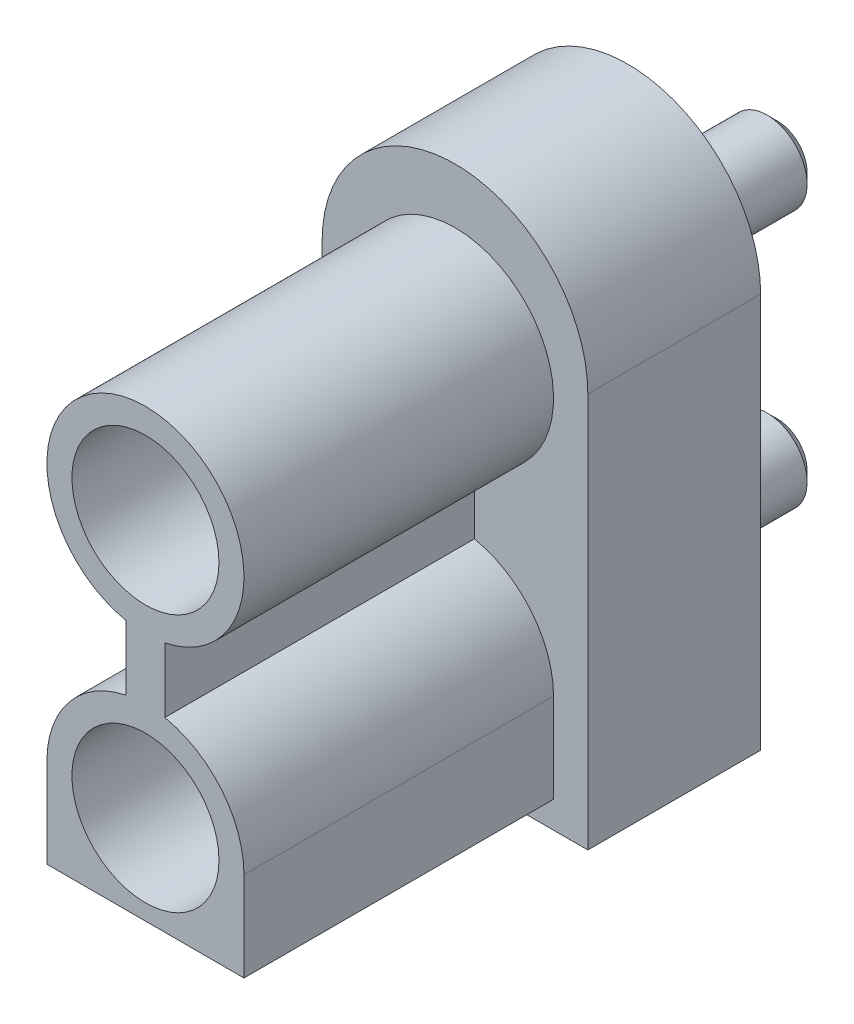
ISO-10303-21;
HEADER;
FILE_DESCRIPTION(('STEP AP214'),'2;1');
FILE_NAME('part.step','',(''),(''),'','','');
FILE_SCHEMA(('AUTOMOTIVE_DESIGN { 1 0 10303 214 1 1 1 1 }'));
ENDSEC;
DATA;
#1=APPLICATION_CONTEXT('core data for automotive mechanical design processes');
#2=APPLICATION_PROTOCOL_DEFINITION('international standard','automotive_design',2000,#1);
#3=PRODUCT_CONTEXT('',#1,'mechanical');
#4=PRODUCT('Part','Part','',(#3));
#5=PRODUCT_RELATED_PRODUCT_CATEGORY('part','',(#4));
#6=PRODUCT_DEFINITION_FORMATION('','',#4);
#7=PRODUCT_DEFINITION_CONTEXT('part definition',#1,'design');
#8=PRODUCT_DEFINITION('design','',#6,#7);
#9=PRODUCT_DEFINITION_SHAPE('','',#8);
#10=(LENGTH_UNIT() NAMED_UNIT(*) SI_UNIT(.MILLI.,.METRE.));
#11=(NAMED_UNIT(*) PLANE_ANGLE_UNIT() SI_UNIT($,.RADIAN.));
#12=(NAMED_UNIT(*) SI_UNIT($,.STERADIAN.) SOLID_ANGLE_UNIT());
#13=UNCERTAINTY_MEASURE_WITH_UNIT(LENGTH_MEASURE(1.E-05),#10,'distance_accuracy_value','');
#14=(GEOMETRIC_REPRESENTATION_CONTEXT(3) GLOBAL_UNCERTAINTY_ASSIGNED_CONTEXT((#13)) GLOBAL_UNIT_ASSIGNED_CONTEXT((#10,
#11,#12)) REPRESENTATION_CONTEXT('',''));
#15=CARTESIAN_POINT('',(0.,0.,0.));
#16=DIRECTION('',(0.,0.,1.));
#17=DIRECTION('',(1.,0.,0.));
#18=AXIS2_PLACEMENT_3D('',#15,#16,#17);
#19=CARTESIAN_POINT('',(0.,7.655,3.35));
#20=DIRECTION('',(0.,0.,-1.));
#21=DIRECTION('',(-1.,0.,0.));
#22=AXIS2_PLACEMENT_3D('',#19,#20,#21);
#23=CYLINDRICAL_SURFACE('',#22,2.575);
#24=CARTESIAN_POINT('',(0.,7.655,0.));
#25=DIRECTION('',(0.,0.,1.));
#26=DIRECTION('',(-1.,0.,0.));
#27=AXIS2_PLACEMENT_3D('',#24,#25,#26);
#28=CIRCLE('',#27,2.575);
#29=CARTESIAN_POINT('',(2.575,7.655,0.));
#30=VERTEX_POINT('',#29);
#31=CARTESIAN_POINT('',(-2.575,7.655,0.));
#32=VERTEX_POINT('',#31);
#33=EDGE_CURVE('E161',#30,#32,#28,.T.);
#34=ORIENTED_EDGE('',*,*,#33,.T.);
#35=DIRECTION('',(0.,0.,-1.));
#36=VECTOR('',#35,1.);
#37=CARTESIAN_POINT('',(-2.575,7.655,3.35));
#38=LINE('',#37,#36);
#39=CARTESIAN_POINT('',(-2.575,7.655,3.35));
#40=VERTEX_POINT('',#39);
#41=EDGE_CURVE('E188',#40,#32,#38,.T.);
#42=ORIENTED_EDGE('',*,*,#41,.F.);
#43=CARTESIAN_POINT('',(0.,7.655,3.35));
#44=DIRECTION('',(0.,0.,1.));
#45=DIRECTION('',(-1.,0.,0.));
#46=AXIS2_PLACEMENT_3D('',#43,#44,#45);
#47=CIRCLE('',#46,2.575);
#48=CARTESIAN_POINT('',(2.575,7.655,3.35));
#49=VERTEX_POINT('',#48);
#50=EDGE_CURVE('E162',#49,#40,#47,.T.);
#51=ORIENTED_EDGE('',*,*,#50,.F.);
#52=DIRECTION('',(0.,0.,-1.));
#53=VECTOR('',#52,1.);
#54=CARTESIAN_POINT('',(2.575,7.655,3.35));
#55=LINE('',#54,#53);
#56=EDGE_CURVE('E172',#49,#30,#55,.T.);
#57=ORIENTED_EDGE('',*,*,#56,.T.);
#58=EDGE_LOOP('',(#34,#42,#51,#57));
#59=FACE_BOUND('',#58,.T.);
#60=ADVANCED_FACE('F38',(#59),#23,.T.);
#61=CARTESIAN_POINT('',(-2.575,7.655,3.35));
#62=DIRECTION('',(1.,0.,0.));
#63=DIRECTION('',(0.,1.,0.));
#64=AXIS2_PLACEMENT_3D('',#61,#62,#63);
#65=PLANE('',#64);
#66=DIRECTION('',(0.,-1.,0.));
#67=VECTOR('',#66,1.);
#68=CARTESIAN_POINT('',(-2.575,7.655,0.));
#69=LINE('',#68,#67);
#70=CARTESIAN_POINT('',(-2.575,0.,0.));
#71=VERTEX_POINT('',#70);
#72=EDGE_CURVE('E175',#32,#71,#69,.T.);
#73=ORIENTED_EDGE('',*,*,#72,.T.);
#74=DIRECTION('',(0.,0.,-1.));
#75=VECTOR('',#74,1.);
#76=CARTESIAN_POINT('',(-2.575,0.,3.35));
#77=LINE('',#76,#75);
#78=CARTESIAN_POINT('',(-2.575,0.,3.35));
#79=VERTEX_POINT('',#78);
#80=EDGE_CURVE('E185',#79,#71,#77,.T.);
#81=ORIENTED_EDGE('',*,*,#80,.F.);
#82=DIRECTION('',(0.,-1.,0.));
#83=VECTOR('',#82,1.);
#84=CARTESIAN_POINT('',(-2.575,7.655,3.35));
#85=LINE('',#84,#83);
#86=EDGE_CURVE('E165',#40,#79,#85,.T.);
#87=ORIENTED_EDGE('',*,*,#86,.F.);
#88=ORIENTED_EDGE('',*,*,#41,.T.);
#89=EDGE_LOOP('',(#73,#81,#87,#88));
#90=FACE_BOUND('',#89,.T.);
#91=ADVANCED_FACE('F213',(#90),#65,.F.);
#92=CARTESIAN_POINT('',(-2.575,0.,3.35));
#93=DIRECTION('',(0.,1.,0.));
#94=DIRECTION('',(0.,0.,1.));
#95=AXIS2_PLACEMENT_3D('',#92,#93,#94);
#96=PLANE('',#95);
#97=DIRECTION('',(1.,0.,0.));
#98=VECTOR('',#97,1.);
#99=CARTESIAN_POINT('',(-2.575,0.,0.));
#100=LINE('',#99,#98);
#101=CARTESIAN_POINT('',(2.575,0.,0.));
#102=VERTEX_POINT('',#101);
#103=EDGE_CURVE('E177',#71,#102,#100,.T.);
#104=ORIENTED_EDGE('',*,*,#103,.T.);
#105=DIRECTION('',(0.,0.,-1.));
#106=VECTOR('',#105,1.);
#107=CARTESIAN_POINT('',(2.575,0.,3.35));
#108=LINE('',#107,#106);
#109=CARTESIAN_POINT('',(2.575,0.,3.35));
#110=VERTEX_POINT('',#109);
#111=EDGE_CURVE('E182',#110,#102,#108,.T.);
#112=ORIENTED_EDGE('',*,*,#111,.F.);
#113=DIRECTION('',(1.,0.,0.));
#114=VECTOR('',#113,1.);
#115=CARTESIAN_POINT('',(-2.575,0.,3.35));
#116=LINE('',#115,#114);
#117=EDGE_CURVE('E168',#79,#110,#116,.T.);
#118=ORIENTED_EDGE('',*,*,#117,.F.);
#119=ORIENTED_EDGE('',*,*,#80,.T.);
#120=EDGE_LOOP('',(#104,#112,#118,#119));
#121=FACE_BOUND('',#120,.T.);
#122=ADVANCED_FACE('F219',(#121),#96,.F.);
#123=CARTESIAN_POINT('',(2.575,0.,3.35));
#124=DIRECTION('',(-1.,0.,0.));
#125=DIRECTION('',(0.,-1.,0.));
#126=AXIS2_PLACEMENT_3D('',#123,#124,#125);
#127=PLANE('',#126);
#128=DIRECTION('',(0.,1.,0.));
#129=VECTOR('',#128,1.);
#130=CARTESIAN_POINT('',(2.575,0.,0.));
#131=LINE('',#130,#129);
#132=EDGE_CURVE('E166',#102,#30,#131,.T.);
#133=ORIENTED_EDGE('',*,*,#132,.T.);
#134=ORIENTED_EDGE('',*,*,#56,.F.);
#135=DIRECTION('',(0.,1.,0.));
#136=VECTOR('',#135,1.);
#137=CARTESIAN_POINT('',(2.575,0.,3.35));
#138=LINE('',#137,#136);
#139=EDGE_CURVE('E170',#110,#49,#138,.T.);
#140=ORIENTED_EDGE('',*,*,#139,.F.);
#141=ORIENTED_EDGE('',*,*,#111,.T.);
#142=EDGE_LOOP('',(#133,#134,#140,#141));
#143=FACE_BOUND('',#142,.T.);
#144=ADVANCED_FACE('F230',(#143),#127,.F.);
#145=CARTESIAN_POINT('',(0.,7.655,3.35));
#146=DIRECTION('',(0.,0.,-1.));
#147=DIRECTION('',(-1.,0.,0.));
#148=AXIS2_PLACEMENT_3D('',#145,#146,#147);
#149=PLANE('',#148);
#150=CARTESIAN_POINT('',(0.,2.25,3.35));
#151=DIRECTION('',(0.,0.,1.));
#152=DIRECTION('',(-1.,0.,0.));
#153=AXIS2_PLACEMENT_3D('',#150,#151,#152);
#154=CIRCLE('',#153,1.91);
#155=CARTESIAN_POINT('',(-0.375,4.12282540563716,3.35));
#156=VERTEX_POINT('',#155);
#157=CARTESIAN_POINT('',(-1.91,2.25,3.35));
#158=VERTEX_POINT('',#157);
#159=EDGE_CURVE('E149',#156,#158,#154,.T.);
#160=ORIENTED_EDGE('',*,*,#159,.F.);
#161=DIRECTION('',(0.,-1.,0.));
#162=VECTOR('',#161,1.);
#163=CARTESIAN_POINT('',(-0.375,5.37717459436284,3.35));
#164=LINE('',#163,#162);
#165=CARTESIAN_POINT('',(-0.375,5.37717459436284,3.35));
#166=VERTEX_POINT('',#165);
#167=EDGE_CURVE('E146',#166,#156,#164,.T.);
#168=ORIENTED_EDGE('',*,*,#167,.F.);
#169=CARTESIAN_POINT('',(0.,7.25,3.35));
#170=DIRECTION('',(0.,0.,1.));
#171=DIRECTION('',(1.,0.,0.));
#172=AXIS2_PLACEMENT_3D('',#169,#170,#171);
#173=CIRCLE('',#172,1.91);
#174=CARTESIAN_POINT('',(0.375,5.37717459436284,3.35));
#175=VERTEX_POINT('',#174);
#176=EDGE_CURVE('E336',#175,#166,#173,.T.);
#177=ORIENTED_EDGE('',*,*,#176,.F.);
#178=DIRECTION('',(0.,1.,0.));
#179=VECTOR('',#178,1.);
#180=CARTESIAN_POINT('',(0.375,5.37717459436284,3.35));
#181=LINE('',#180,#179);
#182=CARTESIAN_POINT('',(0.375000000000001,4.12282540563716,3.35));
#183=VERTEX_POINT('',#182);
#184=EDGE_CURVE('E333',#183,#175,#181,.T.);
#185=ORIENTED_EDGE('',*,*,#184,.F.);
#186=CARTESIAN_POINT('',(0.,2.25,3.35));
#187=DIRECTION('',(0.,0.,1.));
#188=DIRECTION('',(-1.,0.,0.));
#189=AXIS2_PLACEMENT_3D('',#186,#187,#188);
#190=CIRCLE('',#189,1.91);
#191=CARTESIAN_POINT('',(1.91,2.25,3.35));
#192=VERTEX_POINT('',#191);
#193=EDGE_CURVE('E330',#192,#183,#190,.T.);
#194=ORIENTED_EDGE('',*,*,#193,.F.);
#195=DIRECTION('',(0.,1.,0.));
#196=VECTOR('',#195,1.);
#197=CARTESIAN_POINT('',(1.91,0.518598550380402,3.35));
#198=LINE('',#197,#196);
#199=CARTESIAN_POINT('',(1.91,0.518598550380402,3.35));
#200=VERTEX_POINT('',#199);
#201=EDGE_CURVE('E327',#200,#192,#198,.T.);
#202=ORIENTED_EDGE('',*,*,#201,.F.);
#203=DIRECTION('',(1.,0.,0.));
#204=VECTOR('',#203,1.);
#205=CARTESIAN_POINT('',(-1.91,0.518598550380402,3.35));
#206=LINE('',#205,#204);
#207=CARTESIAN_POINT('',(-1.91,0.518598550380402,3.35));
#208=VERTEX_POINT('',#207);
#209=EDGE_CURVE('E59',#208,#200,#206,.T.);
#210=ORIENTED_EDGE('',*,*,#209,.F.);
#211=DIRECTION('',(0.,-1.,0.));
#212=VECTOR('',#211,1.);
#213=CARTESIAN_POINT('',(-1.91,2.25,3.35));
#214=LINE('',#213,#212);
#215=EDGE_CURVE('E54',#158,#208,#214,.T.);
#216=ORIENTED_EDGE('',*,*,#215,.F.);
#217=EDGE_LOOP('',(#160,#168,#177,#185,#194,#202,#210,#216));
#218=FACE_BOUND('',#217,.T.);
#219=ORIENTED_EDGE('',*,*,#50,.T.);
#220=ORIENTED_EDGE('',*,*,#86,.T.);
#221=ORIENTED_EDGE('',*,*,#117,.T.);
#222=ORIENTED_EDGE('',*,*,#139,.T.);
#223=EDGE_LOOP('',(#219,#220,#221,#222));
#224=FACE_BOUND('',#223,.T.);
#225=ADVANCED_FACE('F234',(#218,#224),#149,.F.);
#226=CARTESIAN_POINT('',(0.,7.655,0.));
#227=DIRECTION('',(0.,0.,-1.));
#228=DIRECTION('',(-1.,0.,0.));
#229=AXIS2_PLACEMENT_3D('',#226,#227,#228);
#230=PLANE('',#229);
#231=CARTESIAN_POINT('',(0.,2.25,0.));
#232=DIRECTION('',(0.,0.,-1.));
#233=DIRECTION('',(-1.,0.,0.));
#234=AXIS2_PLACEMENT_3D('',#231,#232,#233);
#235=CIRCLE('',#234,0.775);
#236=CARTESIAN_POINT('',(-0.775,2.25,0.));
#237=VERTEX_POINT('',#236);
#238=EDGE_CURVE('E150',#237,#237,#235,.T.);
#239=ORIENTED_EDGE('',*,*,#238,.F.);
#240=EDGE_LOOP('',(#239));
#241=FACE_BOUND('',#240,.T.);
#242=CARTESIAN_POINT('',(0.,7.25,0.));
#243=DIRECTION('',(0.,0.,-1.));
#244=DIRECTION('',(-1.,0.,0.));
#245=AXIS2_PLACEMENT_3D('',#242,#243,#244);
#246=CIRCLE('',#245,0.775);
#247=CARTESIAN_POINT('',(-0.775,7.25,0.));
#248=VERTEX_POINT('',#247);
#249=EDGE_CURVE('E153',#248,#248,#246,.T.);
#250=ORIENTED_EDGE('',*,*,#249,.F.);
#251=EDGE_LOOP('',(#250));
#252=FACE_BOUND('',#251,.T.);
#253=ORIENTED_EDGE('',*,*,#33,.F.);
#254=ORIENTED_EDGE('',*,*,#132,.F.);
#255=ORIENTED_EDGE('',*,*,#103,.F.);
#256=ORIENTED_EDGE('',*,*,#72,.F.);
#257=EDGE_LOOP('',(#253,#254,#255,#256));
#258=FACE_BOUND('',#257,.T.);
#259=ADVANCED_FACE('F236',(#241,#252,#258),#230,.T.);
#260=CARTESIAN_POINT('',(0.,7.25,-2.9));
#261=DIRECTION('',(0.,0.,1.));
#262=DIRECTION('',(1.,0.,0.));
#263=AXIS2_PLACEMENT_3D('',#260,#261,#262);
#264=CYLINDRICAL_SURFACE('',#263,0.775);
#265=CARTESIAN_POINT('',(0.,7.25,-2.7));
#266=DIRECTION('',(0.,0.,-1.));
#267=DIRECTION('',(-1.,0.,0.));
#268=AXIS2_PLACEMENT_3D('',#265,#266,#267);
#269=CIRCLE('',#268,0.775);
#270=CARTESIAN_POINT('',(-0.775,7.25,-2.7));
#271=VERTEX_POINT('',#270);
#272=EDGE_CURVE('E11',#271,#271,#269,.F.);
#273=ORIENTED_EDGE('',*,*,#272,.T.);
#274=EDGE_LOOP('',(#273));
#275=FACE_BOUND('',#274,.T.);
#276=ORIENTED_EDGE('',*,*,#249,.T.);
#277=EDGE_LOOP('',(#276));
#278=FACE_BOUND('',#277,.T.);
#279=ADVANCED_FACE('F239',(#275,#278),#264,.T.);
#280=CARTESIAN_POINT('',(0.,7.25,-2.9));
#281=DIRECTION('',(0.,0.,-1.));
#282=DIRECTION('',(-1.,0.,0.));
#283=AXIS2_PLACEMENT_3D('',#280,#281,#282);
#284=PLANE('',#283);
#285=CARTESIAN_POINT('',(0.,7.25,-2.9));
#286=DIRECTION('',(0.,0.,-1.));
#287=DIRECTION('',(-1.,0.,0.));
#288=AXIS2_PLACEMENT_3D('',#285,#286,#287);
#289=CIRCLE('',#288,0.574999999999999);
#290=CARTESIAN_POINT('',(-0.574999999999999,7.25,-2.9));
#291=VERTEX_POINT('',#290);
#292=EDGE_CURVE('E47',#291,#291,#289,.T.);
#293=ORIENTED_EDGE('',*,*,#292,.T.);
#294=EDGE_LOOP('',(#293));
#295=FACE_BOUND('',#294,.T.);
#296=ADVANCED_FACE('F199',(#295),#284,.T.);
#297=CARTESIAN_POINT('',(0.,2.25,-2.9));
#298=DIRECTION('',(0.,0.,1.));
#299=DIRECTION('',(1.,0.,0.));
#300=AXIS2_PLACEMENT_3D('',#297,#298,#299);
#301=CYLINDRICAL_SURFACE('',#300,0.775);
#302=CARTESIAN_POINT('',(0.,2.25,-2.7));
#303=DIRECTION('',(0.,0.,-1.));
#304=DIRECTION('',(-1.,0.,0.));
#305=AXIS2_PLACEMENT_3D('',#302,#303,#304);
#306=CIRCLE('',#305,0.775);
#307=CARTESIAN_POINT('',(-0.775,2.25,-2.7));
#308=VERTEX_POINT('',#307);
#309=EDGE_CURVE('E194',#308,#308,#306,.F.);
#310=ORIENTED_EDGE('',*,*,#309,.T.);
#311=EDGE_LOOP('',(#310));
#312=FACE_BOUND('',#311,.T.);
#313=ORIENTED_EDGE('',*,*,#238,.T.);
#314=EDGE_LOOP('',(#313));
#315=FACE_BOUND('',#314,.T.);
#316=ADVANCED_FACE('F250',(#312,#315),#301,.T.);
#317=CARTESIAN_POINT('',(0.,2.25,-2.9));
#318=DIRECTION('',(0.,0.,-1.));
#319=DIRECTION('',(-1.,0.,0.));
#320=AXIS2_PLACEMENT_3D('',#317,#318,#319);
#321=PLANE('',#320);
#322=CARTESIAN_POINT('',(0.,2.25,-2.9));
#323=DIRECTION('',(0.,0.,-1.));
#324=DIRECTION('',(-1.,0.,0.));
#325=AXIS2_PLACEMENT_3D('',#322,#323,#324);
#326=CIRCLE('',#325,0.575000000000001);
#327=CARTESIAN_POINT('',(-0.575000000000001,2.25,-2.9));
#328=VERTEX_POINT('',#327);
#329=EDGE_CURVE('E191',#328,#328,#326,.T.);
#330=ORIENTED_EDGE('',*,*,#329,.T.);
#331=EDGE_LOOP('',(#330));
#332=FACE_BOUND('',#331,.T.);
#333=ADVANCED_FACE('F209',(#332),#321,.T.);
#334=CARTESIAN_POINT('',(0.,2.25,-2.9));
#335=DIRECTION('',(0.,0.,1.));
#336=DIRECTION('',(1.,0.,0.));
#337=AXIS2_PLACEMENT_3D('',#334,#335,#336);
#338=CONICAL_SURFACE('',#337,0.575000000000001,0.785398163397447);
#339=ORIENTED_EDGE('',*,*,#309,.F.);
#340=EDGE_LOOP('',(#339));
#341=FACE_BOUND('',#340,.T.);
#342=ORIENTED_EDGE('',*,*,#329,.F.);
#343=EDGE_LOOP('',(#342));
#344=FACE_BOUND('',#343,.T.);
#345=ADVANCED_FACE('F202',(#341,#344),#338,.T.);
#346=CARTESIAN_POINT('',(0.,7.25,-2.9));
#347=DIRECTION('',(0.,0.,1.));
#348=DIRECTION('',(1.,0.,0.));
#349=AXIS2_PLACEMENT_3D('',#346,#347,#348);
#350=CONICAL_SURFACE('',#349,0.574999999999999,0.785398163397446);
#351=ORIENTED_EDGE('',*,*,#272,.F.);
#352=EDGE_LOOP('',(#351));
#353=FACE_BOUND('',#352,.T.);
#354=ORIENTED_EDGE('',*,*,#292,.F.);
#355=EDGE_LOOP('',(#354));
#356=FACE_BOUND('',#355,.T.);
#357=ADVANCED_FACE('F41',(#353,#356),#350,.T.);
#358=CARTESIAN_POINT('',(0.,2.25,9.35));
#359=DIRECTION('',(0.,0.,-1.));
#360=DIRECTION('',(-1.,0.,0.));
#361=AXIS2_PLACEMENT_3D('',#358,#359,#360);
#362=PLANE('',#361);
#363=CARTESIAN_POINT('',(0.,2.25,9.35));
#364=DIRECTION('',(0.,0.,1.));
#365=DIRECTION('',(-1.,0.,0.));
#366=AXIS2_PLACEMENT_3D('',#363,#364,#365);
#367=CIRCLE('',#366,1.91);
#368=CARTESIAN_POINT('',(-0.375,4.12282540563716,9.35));
#369=VERTEX_POINT('',#368);
#370=CARTESIAN_POINT('',(-1.91,2.25,9.35));
#371=VERTEX_POINT('',#370);
#372=EDGE_CURVE('E136',#369,#371,#367,.T.);
#373=ORIENTED_EDGE('',*,*,#372,.T.);
#374=DIRECTION('',(0.,-1.,0.));
#375=VECTOR('',#374,1.);
#376=CARTESIAN_POINT('',(-1.91,2.25,9.35));
#377=LINE('',#376,#375);
#378=CARTESIAN_POINT('',(-1.91,0.518598550380402,9.35));
#379=VERTEX_POINT('',#378);
#380=EDGE_CURVE('E125',#371,#379,#377,.T.);
#381=ORIENTED_EDGE('',*,*,#380,.T.);
#382=DIRECTION('',(1.,0.,0.));
#383=VECTOR('',#382,1.);
#384=CARTESIAN_POINT('',(-1.91,0.518598550380402,9.35));
#385=LINE('',#384,#383);
#386=CARTESIAN_POINT('',(1.91,0.518598550380402,9.35));
#387=VERTEX_POINT('',#386);
#388=EDGE_CURVE('E135',#379,#387,#385,.T.);
#389=ORIENTED_EDGE('',*,*,#388,.T.);
#390=DIRECTION('',(0.,1.,0.));
#391=VECTOR('',#390,1.);
#392=CARTESIAN_POINT('',(1.91,0.518598550380402,9.35));
#393=LINE('',#392,#391);
#394=CARTESIAN_POINT('',(1.91,2.25,9.35));
#395=VERTEX_POINT('',#394);
#396=EDGE_CURVE('E314',#387,#395,#393,.T.);
#397=ORIENTED_EDGE('',*,*,#396,.T.);
#398=CARTESIAN_POINT('',(0.,2.25,9.35));
#399=DIRECTION('',(0.,0.,1.));
#400=DIRECTION('',(-1.,0.,0.));
#401=AXIS2_PLACEMENT_3D('',#398,#399,#400);
#402=CIRCLE('',#401,1.91);
#403=CARTESIAN_POINT('',(0.375000000000001,4.12282540563716,9.35));
#404=VERTEX_POINT('',#403);
#405=EDGE_CURVE('E316',#395,#404,#402,.T.);
#406=ORIENTED_EDGE('',*,*,#405,.T.);
#407=DIRECTION('',(0.,1.,0.));
#408=VECTOR('',#407,1.);
#409=CARTESIAN_POINT('',(0.375,5.37717459436284,9.35));
#410=LINE('',#409,#408);
#411=CARTESIAN_POINT('',(0.375,5.37717459436284,9.35));
#412=VERTEX_POINT('',#411);
#413=EDGE_CURVE('E318',#404,#412,#410,.T.);
#414=ORIENTED_EDGE('',*,*,#413,.T.);
#415=CARTESIAN_POINT('',(0.,7.25,9.35));
#416=DIRECTION('',(0.,0.,1.));
#417=DIRECTION('',(1.,0.,0.));
#418=AXIS2_PLACEMENT_3D('',#415,#416,#417);
#419=CIRCLE('',#418,1.91);
#420=CARTESIAN_POINT('',(-0.375,5.37717459436284,9.35));
#421=VERTEX_POINT('',#420);
#422=EDGE_CURVE('E320',#412,#421,#419,.T.);
#423=ORIENTED_EDGE('',*,*,#422,.T.);
#424=DIRECTION('',(0.,-1.,0.));
#425=VECTOR('',#424,1.);
#426=CARTESIAN_POINT('',(-0.375,5.37717459436284,9.35));
#427=LINE('',#426,#425);
#428=EDGE_CURVE('E142',#421,#369,#427,.T.);
#429=ORIENTED_EDGE('',*,*,#428,.T.);
#430=EDGE_LOOP('',(#373,#381,#389,#397,#406,#414,#423,#429));
#431=FACE_BOUND('',#430,.T.);
#432=CARTESIAN_POINT('',(0.,2.25,9.35));
#433=DIRECTION('',(0.,0.,1.));
#434=DIRECTION('',(1.,0.,0.));
#435=AXIS2_PLACEMENT_3D('',#432,#433,#434);
#436=CIRCLE('',#435,1.425);
#437=CARTESIAN_POINT('',(1.425,2.25,9.35));
#438=VERTEX_POINT('',#437);
#439=EDGE_CURVE('E308',#438,#438,#436,.T.);
#440=ORIENTED_EDGE('',*,*,#439,.F.);
#441=EDGE_LOOP('',(#440));
#442=FACE_BOUND('',#441,.T.);
#443=CARTESIAN_POINT('',(0.,7.25,9.35));
#444=DIRECTION('',(0.,0.,1.));
#445=DIRECTION('',(1.,0.,0.));
#446=AXIS2_PLACEMENT_3D('',#443,#444,#445);
#447=CIRCLE('',#446,1.425);
#448=CARTESIAN_POINT('',(1.425,7.25,9.35));
#449=VERTEX_POINT('',#448);
#450=EDGE_CURVE('E299',#449,#449,#447,.T.);
#451=ORIENTED_EDGE('',*,*,#450,.F.);
#452=EDGE_LOOP('',(#451));
#453=FACE_BOUND('',#452,.T.);
#454=ADVANCED_FACE('F139',(#431,#442,#453),#362,.F.);
#455=CARTESIAN_POINT('',(0.,2.25,9.35));
#456=DIRECTION('',(0.,0.,-1.));
#457=DIRECTION('',(-1.,0.,0.));
#458=AXIS2_PLACEMENT_3D('',#455,#456,#457);
#459=CYLINDRICAL_SURFACE('',#458,1.91);
#460=ORIENTED_EDGE('',*,*,#159,.T.);
#461=DIRECTION('',(0.,0.,-1.));
#462=VECTOR('',#461,1.);
#463=CARTESIAN_POINT('',(-1.91,2.25,9.35));
#464=LINE('',#463,#462);
#465=EDGE_CURVE('E129',#371,#158,#464,.T.);
#466=ORIENTED_EDGE('',*,*,#465,.F.);
#467=ORIENTED_EDGE('',*,*,#372,.F.);
#468=DIRECTION('',(0.,0.,-1.));
#469=VECTOR('',#468,1.);
#470=CARTESIAN_POINT('',(-0.375,4.12282540563716,9.35));
#471=LINE('',#470,#469);
#472=EDGE_CURVE('E323',#369,#156,#471,.T.);
#473=ORIENTED_EDGE('',*,*,#472,.T.);
#474=EDGE_LOOP('',(#460,#466,#467,#473));
#475=FACE_BOUND('',#474,.T.);
#476=ADVANCED_FACE('F148',(#475),#459,.T.);
#477=CARTESIAN_POINT('',(-1.91,2.25,9.35));
#478=DIRECTION('',(1.,0.,0.));
#479=DIRECTION('',(0.,1.,0.));
#480=AXIS2_PLACEMENT_3D('',#477,#478,#479);
#481=PLANE('',#480);
#482=ORIENTED_EDGE('',*,*,#215,.T.);
#483=DIRECTION('',(0.,0.,-1.));
#484=VECTOR('',#483,1.);
#485=CARTESIAN_POINT('',(-1.91,0.518598550380402,9.35));
#486=LINE('',#485,#484);
#487=EDGE_CURVE('E132',#379,#208,#486,.T.);
#488=ORIENTED_EDGE('',*,*,#487,.F.);
#489=ORIENTED_EDGE('',*,*,#380,.F.);
#490=ORIENTED_EDGE('',*,*,#465,.T.);
#491=EDGE_LOOP('',(#482,#488,#489,#490));
#492=FACE_BOUND('',#491,.T.);
#493=ADVANCED_FACE('F127',(#492),#481,.F.);
#494=CARTESIAN_POINT('',(-1.91,0.518598550380402,9.35));
#495=DIRECTION('',(0.,1.,0.));
#496=DIRECTION('',(0.,0.,1.));
#497=AXIS2_PLACEMENT_3D('',#494,#495,#496);
#498=PLANE('',#497);
#499=ORIENTED_EDGE('',*,*,#209,.T.);
#500=DIRECTION('',(0.,0.,-1.));
#501=VECTOR('',#500,1.);
#502=CARTESIAN_POINT('',(1.91,0.518598550380402,9.35));
#503=LINE('',#502,#501);
#504=EDGE_CURVE('E155',#387,#200,#503,.T.);
#505=ORIENTED_EDGE('',*,*,#504,.F.);
#506=ORIENTED_EDGE('',*,*,#388,.F.);
#507=ORIENTED_EDGE('',*,*,#487,.T.);
#508=EDGE_LOOP('',(#499,#505,#506,#507));
#509=FACE_BOUND('',#508,.T.);
#510=ADVANCED_FACE('F261',(#509),#498,.F.);
#511=CARTESIAN_POINT('',(1.91,0.518598550380402,9.35));
#512=DIRECTION('',(-1.,0.,0.));
#513=DIRECTION('',(0.,-1.,0.));
#514=AXIS2_PLACEMENT_3D('',#511,#512,#513);
#515=PLANE('',#514);
#516=ORIENTED_EDGE('',*,*,#201,.T.);
#517=DIRECTION('',(0.,0.,-1.));
#518=VECTOR('',#517,1.);
#519=CARTESIAN_POINT('',(1.91,2.25,9.35));
#520=LINE('',#519,#518);
#521=EDGE_CURVE('E351',#395,#192,#520,.T.);
#522=ORIENTED_EDGE('',*,*,#521,.F.);
#523=ORIENTED_EDGE('',*,*,#396,.F.);
#524=ORIENTED_EDGE('',*,*,#504,.T.);
#525=EDGE_LOOP('',(#516,#522,#523,#524));
#526=FACE_BOUND('',#525,.T.);
#527=ADVANCED_FACE('F264',(#526),#515,.F.);
#528=CARTESIAN_POINT('',(0.,2.25,9.35));
#529=DIRECTION('',(0.,0.,-1.));
#530=DIRECTION('',(-1.,0.,0.));
#531=AXIS2_PLACEMENT_3D('',#528,#529,#530);
#532=CYLINDRICAL_SURFACE('',#531,1.91);
#533=ORIENTED_EDGE('',*,*,#193,.T.);
#534=DIRECTION('',(0.,0.,-1.));
#535=VECTOR('',#534,1.);
#536=CARTESIAN_POINT('',(0.375000000000001,4.12282540563716,9.35));
#537=LINE('',#536,#535);
#538=EDGE_CURVE('E348',#404,#183,#537,.T.);
#539=ORIENTED_EDGE('',*,*,#538,.F.);
#540=ORIENTED_EDGE('',*,*,#405,.F.);
#541=ORIENTED_EDGE('',*,*,#521,.T.);
#542=EDGE_LOOP('',(#533,#539,#540,#541));
#543=FACE_BOUND('',#542,.T.);
#544=ADVANCED_FACE('F268',(#543),#532,.T.);
#545=CARTESIAN_POINT('',(0.375,5.37717459436284,9.35));
#546=DIRECTION('',(-1.,0.,0.));
#547=DIRECTION('',(0.,-1.,0.));
#548=AXIS2_PLACEMENT_3D('',#545,#546,#547);
#549=PLANE('',#548);
#550=ORIENTED_EDGE('',*,*,#184,.T.);
#551=DIRECTION('',(0.,0.,-1.));
#552=VECTOR('',#551,1.);
#553=CARTESIAN_POINT('',(0.375,5.37717459436284,9.35));
#554=LINE('',#553,#552);
#555=EDGE_CURVE('E345',#412,#175,#554,.T.);
#556=ORIENTED_EDGE('',*,*,#555,.F.);
#557=ORIENTED_EDGE('',*,*,#413,.F.);
#558=ORIENTED_EDGE('',*,*,#538,.T.);
#559=EDGE_LOOP('',(#550,#556,#557,#558));
#560=FACE_BOUND('',#559,.T.);
#561=ADVANCED_FACE('F272',(#560),#549,.F.);
#562=CARTESIAN_POINT('',(0.,7.25,9.35));
#563=DIRECTION('',(0.,0.,-1.));
#564=DIRECTION('',(-1.,0.,0.));
#565=AXIS2_PLACEMENT_3D('',#562,#563,#564);
#566=CYLINDRICAL_SURFACE('',#565,1.91);
#567=ORIENTED_EDGE('',*,*,#176,.T.);
#568=DIRECTION('',(0.,0.,-1.));
#569=VECTOR('',#568,1.);
#570=CARTESIAN_POINT('',(-0.375,5.37717459436284,9.35));
#571=LINE('',#570,#569);
#572=EDGE_CURVE('E342',#421,#166,#571,.T.);
#573=ORIENTED_EDGE('',*,*,#572,.F.);
#574=ORIENTED_EDGE('',*,*,#422,.F.);
#575=ORIENTED_EDGE('',*,*,#555,.T.);
#576=EDGE_LOOP('',(#567,#573,#574,#575));
#577=FACE_BOUND('',#576,.T.);
#578=ADVANCED_FACE('F276',(#577),#566,.T.);
#579=CARTESIAN_POINT('',(-0.375,5.37717459436284,9.35));
#580=DIRECTION('',(1.,0.,0.));
#581=DIRECTION('',(0.,1.,0.));
#582=AXIS2_PLACEMENT_3D('',#579,#580,#581);
#583=PLANE('',#582);
#584=ORIENTED_EDGE('',*,*,#167,.T.);
#585=ORIENTED_EDGE('',*,*,#472,.F.);
#586=ORIENTED_EDGE('',*,*,#428,.F.);
#587=ORIENTED_EDGE('',*,*,#572,.T.);
#588=EDGE_LOOP('',(#584,#585,#586,#587));
#589=FACE_BOUND('',#588,.T.);
#590=ADVANCED_FACE('F280',(#589),#583,.F.);
#591=CARTESIAN_POINT('',(0.,2.25,9.35));
#592=DIRECTION('',(0.,0.,-1.));
#593=DIRECTION('',(-1.,0.,0.));
#594=AXIS2_PLACEMENT_3D('',#591,#592,#593);
#595=CYLINDRICAL_SURFACE('',#594,1.425);
#596=ORIENTED_EDGE('',*,*,#439,.T.);
#597=EDGE_LOOP('',(#596));
#598=FACE_BOUND('',#597,.T.);
#599=CARTESIAN_POINT('',(0.,2.25,3.35));
#600=DIRECTION('',(0.,0.,1.));
#601=DIRECTION('',(1.,0.,0.));
#602=AXIS2_PLACEMENT_3D('',#599,#600,#601);
#603=CIRCLE('',#602,1.425);
#604=CARTESIAN_POINT('',(1.425,2.25,3.35));
#605=VERTEX_POINT('',#604);
#606=EDGE_CURVE('E305',#605,#605,#603,.T.);
#607=ORIENTED_EDGE('',*,*,#606,.F.);
#608=EDGE_LOOP('',(#607));
#609=FACE_BOUND('',#608,.T.);
#610=ADVANCED_FACE('F283',(#598,#609),#595,.F.);
#611=CARTESIAN_POINT('',(0.,7.25,9.35));
#612=DIRECTION('',(0.,0.,-1.));
#613=DIRECTION('',(-1.,0.,0.));
#614=AXIS2_PLACEMENT_3D('',#611,#612,#613);
#615=CYLINDRICAL_SURFACE('',#614,1.425);
#616=ORIENTED_EDGE('',*,*,#450,.T.);
#617=EDGE_LOOP('',(#616));
#618=FACE_BOUND('',#617,.T.);
#619=CARTESIAN_POINT('',(0.,7.25,3.35));
#620=DIRECTION('',(0.,0.,1.));
#621=DIRECTION('',(1.,0.,0.));
#622=AXIS2_PLACEMENT_3D('',#619,#620,#621);
#623=CIRCLE('',#622,1.425);
#624=CARTESIAN_POINT('',(1.425,7.25,3.35));
#625=VERTEX_POINT('',#624);
#626=EDGE_CURVE('E302',#625,#625,#623,.T.);
#627=ORIENTED_EDGE('',*,*,#626,.F.);
#628=EDGE_LOOP('',(#627));
#629=FACE_BOUND('',#628,.T.);
#630=ADVANCED_FACE('F288',(#618,#629),#615,.F.);
#631=ORIENTED_EDGE('',*,*,#606,.T.);
#632=EDGE_LOOP('',(#631));
#633=FACE_BOUND('',#632,.T.);
#634=ADVANCED_FACE('F243',(#633),#149,.F.);
#635=ORIENTED_EDGE('',*,*,#626,.T.);
#636=EDGE_LOOP('',(#635));
#637=FACE_BOUND('',#636,.T.);
#638=ADVANCED_FACE('F244',(#637),#149,.F.);
#639=CLOSED_SHELL('',(#60,#91,#122,#144,#225,#259,#279,#296,#316,#333,#345,#357,#454,#476,#493,
#510,#527,#544,#561,#578,#590,#610,#630,#634,#638));
#640=MANIFOLD_SOLID_BREP('B2',#639);
#641=ADVANCED_BREP_SHAPE_REPRESENTATION('',(#18,#640),#14);
#642=SHAPE_DEFINITION_REPRESENTATION(#9,#641);
ENDSEC;
END-ISO-10303-21;
